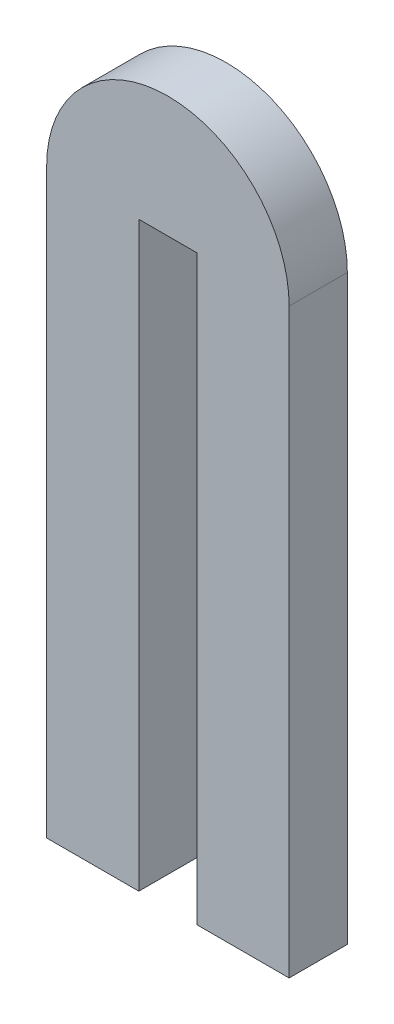
ISO-10303-21;
HEADER;
FILE_DESCRIPTION(('STEP AP214'),'2;1');
FILE_NAME('part.step','',(''),(''),'','','');
FILE_SCHEMA(('AUTOMOTIVE_DESIGN { 1 0 10303 214 1 1 1 1 }'));
ENDSEC;
DATA;
#1=APPLICATION_CONTEXT('core data for automotive mechanical design processes');
#2=APPLICATION_PROTOCOL_DEFINITION('international standard','automotive_design',2000,#1);
#3=PRODUCT_CONTEXT('',#1,'mechanical');
#4=PRODUCT('Part','Part','',(#3));
#5=PRODUCT_RELATED_PRODUCT_CATEGORY('part','',(#4));
#6=PRODUCT_DEFINITION_FORMATION('','',#4);
#7=PRODUCT_DEFINITION_CONTEXT('part definition',#1,'design');
#8=PRODUCT_DEFINITION('design','',#6,#7);
#9=PRODUCT_DEFINITION_SHAPE('','',#8);
#10=(LENGTH_UNIT() NAMED_UNIT(*) SI_UNIT(.MILLI.,.METRE.));
#11=(NAMED_UNIT(*) PLANE_ANGLE_UNIT() SI_UNIT($,.RADIAN.));
#12=(NAMED_UNIT(*) SI_UNIT($,.STERADIAN.) SOLID_ANGLE_UNIT());
#13=UNCERTAINTY_MEASURE_WITH_UNIT(LENGTH_MEASURE(1.E-05),#10,'distance_accuracy_value','');
#14=(GEOMETRIC_REPRESENTATION_CONTEXT(3) GLOBAL_UNCERTAINTY_ASSIGNED_CONTEXT((#13)) GLOBAL_UNIT_ASSIGNED_CONTEXT((#10,
#11,#12)) REPRESENTATION_CONTEXT('',''));
#15=CARTESIAN_POINT('',(0.,0.,0.));
#16=DIRECTION('',(0.,0.,1.));
#17=DIRECTION('',(1.,0.,0.));
#18=AXIS2_PLACEMENT_3D('',#15,#16,#17);
#19=CARTESIAN_POINT('',(6.25,15.,1.5));
#20=DIRECTION('',(-1.,0.,0.));
#21=DIRECTION('',(0.,-1.,0.));
#22=AXIS2_PLACEMENT_3D('',#19,#20,#21);
#23=PLANE('',#22);
#24=DIRECTION('',(0.,1.,0.));
#25=VECTOR('',#24,1.);
#26=CARTESIAN_POINT('',(6.25,15.,-1.5));
#27=LINE('',#26,#25);
#28=CARTESIAN_POINT('',(6.25,-15.,-1.5));
#29=VERTEX_POINT('',#28);
#30=CARTESIAN_POINT('',(6.25,15.,-1.5));
#31=VERTEX_POINT('',#30);
#32=EDGE_CURVE('E129',#29,#31,#27,.T.);
#33=ORIENTED_EDGE('',*,*,#32,.T.);
#34=DIRECTION('',(0.,0.,-1.));
#35=VECTOR('',#34,1.);
#36=CARTESIAN_POINT('',(6.25,15.,1.5));
#37=LINE('',#36,#35);
#38=CARTESIAN_POINT('',(6.25,15.,1.5));
#39=VERTEX_POINT('',#38);
#40=EDGE_CURVE('E11',#39,#31,#37,.T.);
#41=ORIENTED_EDGE('',*,*,#40,.F.);
#42=DIRECTION('',(0.,1.,0.));
#43=VECTOR('',#42,1.);
#44=CARTESIAN_POINT('',(6.25,15.,1.5));
#45=LINE('',#44,#43);
#46=CARTESIAN_POINT('',(6.25,-15.,1.5));
#47=VERTEX_POINT('',#46);
#48=EDGE_CURVE('E143',#47,#39,#45,.T.);
#49=ORIENTED_EDGE('',*,*,#48,.F.);
#50=DIRECTION('',(0.,0.,-1.));
#51=VECTOR('',#50,1.);
#52=CARTESIAN_POINT('',(6.25,-15.,1.5));
#53=LINE('',#52,#51);
#54=EDGE_CURVE('E125',#47,#29,#53,.T.);
#55=ORIENTED_EDGE('',*,*,#54,.T.);
#56=EDGE_LOOP('',(#33,#41,#49,#55));
#57=FACE_BOUND('',#56,.T.);
#58=ADVANCED_FACE('F33',(#57),#23,.F.);
#59=CARTESIAN_POINT('',(0.,15.,1.5));
#60=DIRECTION('',(0.,0.,-1.));
#61=DIRECTION('',(-1.,0.,0.));
#62=AXIS2_PLACEMENT_3D('',#59,#60,#61);
#63=CYLINDRICAL_SURFACE('',#62,6.25);
#64=CARTESIAN_POINT('',(0.,15.,-1.5));
#65=DIRECTION('',(0.,0.,1.));
#66=DIRECTION('',(1.,0.,0.));
#67=AXIS2_PLACEMENT_3D('',#64,#65,#66);
#68=CIRCLE('',#67,6.25);
#69=CARTESIAN_POINT('',(-6.25,15.,-1.5));
#70=VERTEX_POINT('',#69);
#71=EDGE_CURVE('E132',#31,#70,#68,.T.);
#72=ORIENTED_EDGE('',*,*,#71,.T.);
#73=DIRECTION('',(0.,0.,-1.));
#74=VECTOR('',#73,1.);
#75=CARTESIAN_POINT('',(-6.25,15.,1.5));
#76=LINE('',#75,#74);
#77=CARTESIAN_POINT('',(-6.25,15.,1.5));
#78=VERTEX_POINT('',#77);
#79=EDGE_CURVE('E41',#78,#70,#76,.T.);
#80=ORIENTED_EDGE('',*,*,#79,.F.);
#81=CARTESIAN_POINT('',(0.,15.,1.5));
#82=DIRECTION('',(0.,0.,1.));
#83=DIRECTION('',(1.,0.,0.));
#84=AXIS2_PLACEMENT_3D('',#81,#82,#83);
#85=CIRCLE('',#84,6.25);
#86=EDGE_CURVE('E92',#39,#78,#85,.T.);
#87=ORIENTED_EDGE('',*,*,#86,.F.);
#88=ORIENTED_EDGE('',*,*,#40,.T.);
#89=EDGE_LOOP('',(#72,#80,#87,#88));
#90=FACE_BOUND('',#89,.T.);
#91=ADVANCED_FACE('F178',(#90),#63,.T.);
#92=CARTESIAN_POINT('',(-6.25,15.,1.5));
#93=DIRECTION('',(1.,0.,0.));
#94=DIRECTION('',(0.,1.,0.));
#95=AXIS2_PLACEMENT_3D('',#92,#93,#94);
#96=PLANE('',#95);
#97=DIRECTION('',(0.,-1.,0.));
#98=VECTOR('',#97,1.);
#99=CARTESIAN_POINT('',(-6.25,15.,-1.5));
#100=LINE('',#99,#98);
#101=CARTESIAN_POINT('',(-6.25,-15.,-1.5));
#102=VERTEX_POINT('',#101);
#103=EDGE_CURVE('E134',#70,#102,#100,.T.);
#104=ORIENTED_EDGE('',*,*,#103,.T.);
#105=DIRECTION('',(0.,0.,-1.));
#106=VECTOR('',#105,1.);
#107=CARTESIAN_POINT('',(-6.25,-15.,1.5));
#108=LINE('',#107,#106);
#109=CARTESIAN_POINT('',(-6.25,-15.,1.5));
#110=VERTEX_POINT('',#109);
#111=EDGE_CURVE('E150',#110,#102,#108,.T.);
#112=ORIENTED_EDGE('',*,*,#111,.F.);
#113=DIRECTION('',(0.,-1.,0.));
#114=VECTOR('',#113,1.);
#115=CARTESIAN_POINT('',(-6.25,15.,1.5));
#116=LINE('',#115,#114);
#117=EDGE_CURVE('E158',#78,#110,#116,.T.);
#118=ORIENTED_EDGE('',*,*,#117,.F.);
#119=ORIENTED_EDGE('',*,*,#79,.T.);
#120=EDGE_LOOP('',(#104,#112,#118,#119));
#121=FACE_BOUND('',#120,.T.);
#122=ADVANCED_FACE('F156',(#121),#96,.F.);
#123=CARTESIAN_POINT('',(-6.25,-15.,1.5));
#124=DIRECTION('',(0.,1.,0.));
#125=DIRECTION('',(0.,0.,1.));
#126=AXIS2_PLACEMENT_3D('',#123,#124,#125);
#127=PLANE('',#126);
#128=DIRECTION('',(1.,0.,0.));
#129=VECTOR('',#128,1.);
#130=CARTESIAN_POINT('',(-6.25,-15.,-1.5));
#131=LINE('',#130,#129);
#132=CARTESIAN_POINT('',(-1.5,-15.,-1.5));
#133=VERTEX_POINT('',#132);
#134=EDGE_CURVE('E136',#102,#133,#131,.T.);
#135=ORIENTED_EDGE('',*,*,#134,.T.);
#136=DIRECTION('',(0.,0.,-1.));
#137=VECTOR('',#136,1.);
#138=CARTESIAN_POINT('',(-1.5,-15.,1.5));
#139=LINE('',#138,#137);
#140=CARTESIAN_POINT('',(-1.5,-15.,1.5));
#141=VERTEX_POINT('',#140);
#142=EDGE_CURVE('E147',#141,#133,#139,.T.);
#143=ORIENTED_EDGE('',*,*,#142,.F.);
#144=DIRECTION('',(1.,0.,0.));
#145=VECTOR('',#144,1.);
#146=CARTESIAN_POINT('',(-6.25,-15.,1.5));
#147=LINE('',#146,#145);
#148=EDGE_CURVE('E170',#110,#141,#147,.T.);
#149=ORIENTED_EDGE('',*,*,#148,.F.);
#150=ORIENTED_EDGE('',*,*,#111,.T.);
#151=EDGE_LOOP('',(#135,#143,#149,#150));
#152=FACE_BOUND('',#151,.T.);
#153=ADVANCED_FACE('F166',(#152),#127,.F.);
#154=CARTESIAN_POINT('',(-1.5,-15.,1.5));
#155=DIRECTION('',(-1.,0.,0.));
#156=DIRECTION('',(0.,0.,1.));
#157=AXIS2_PLACEMENT_3D('',#154,#155,#156);
#158=PLANE('',#157);
#159=DIRECTION('',(0.,1.,0.));
#160=VECTOR('',#159,1.);
#161=CARTESIAN_POINT('',(-1.5,-15.,-1.5));
#162=LINE('',#161,#160);
#163=CARTESIAN_POINT('',(-1.5,15.,-1.5));
#164=VERTEX_POINT('',#163);
#165=EDGE_CURVE('E138',#133,#164,#162,.T.);
#166=ORIENTED_EDGE('',*,*,#165,.T.);
#167=DIRECTION('',(0.,0.,-1.));
#168=VECTOR('',#167,1.);
#169=CARTESIAN_POINT('',(-1.5,15.,1.5));
#170=LINE('',#169,#168);
#171=CARTESIAN_POINT('',(-1.5,15.,1.5));
#172=VERTEX_POINT('',#171);
#173=EDGE_CURVE('E120',#172,#164,#170,.T.);
#174=ORIENTED_EDGE('',*,*,#173,.F.);
#175=DIRECTION('',(0.,1.,0.));
#176=VECTOR('',#175,1.);
#177=CARTESIAN_POINT('',(-1.5,-15.,1.5));
#178=LINE('',#177,#176);
#179=EDGE_CURVE('E111',#141,#172,#178,.T.);
#180=ORIENTED_EDGE('',*,*,#179,.F.);
#181=ORIENTED_EDGE('',*,*,#142,.T.);
#182=EDGE_LOOP('',(#166,#174,#180,#181));
#183=FACE_BOUND('',#182,.T.);
#184=ADVANCED_FACE('F169',(#183),#158,.F.);
#185=CARTESIAN_POINT('',(-1.5,15.,1.5));
#186=DIRECTION('',(0.,1.,0.));
#187=DIRECTION('',(0.,0.,1.));
#188=AXIS2_PLACEMENT_3D('',#185,#186,#187);
#189=PLANE('',#188);
#190=DIRECTION('',(1.,0.,0.));
#191=VECTOR('',#190,1.);
#192=CARTESIAN_POINT('',(-1.5,15.,-1.5));
#193=LINE('',#192,#191);
#194=CARTESIAN_POINT('',(1.5,15.,-1.5));
#195=VERTEX_POINT('',#194);
#196=EDGE_CURVE('E119',#164,#195,#193,.T.);
#197=ORIENTED_EDGE('',*,*,#196,.T.);
#198=DIRECTION('',(0.,0.,-1.));
#199=VECTOR('',#198,1.);
#200=CARTESIAN_POINT('',(1.5,15.,1.5));
#201=LINE('',#200,#199);
#202=CARTESIAN_POINT('',(1.5,15.,1.5));
#203=VERTEX_POINT('',#202);
#204=EDGE_CURVE('E116',#203,#195,#201,.T.);
#205=ORIENTED_EDGE('',*,*,#204,.F.);
#206=DIRECTION('',(1.,0.,0.));
#207=VECTOR('',#206,1.);
#208=CARTESIAN_POINT('',(-1.5,15.,1.5));
#209=LINE('',#208,#207);
#210=EDGE_CURVE('E105',#172,#203,#209,.T.);
#211=ORIENTED_EDGE('',*,*,#210,.F.);
#212=ORIENTED_EDGE('',*,*,#173,.T.);
#213=EDGE_LOOP('',(#197,#205,#211,#212));
#214=FACE_BOUND('',#213,.T.);
#215=ADVANCED_FACE('F117',(#214),#189,.F.);
#216=CARTESIAN_POINT('',(1.5,-15.,1.5));
#217=DIRECTION('',(1.,0.,0.));
#218=DIRECTION('',(0.,0.,-1.));
#219=AXIS2_PLACEMENT_3D('',#216,#217,#218);
#220=PLANE('',#219);
#221=DIRECTION('',(0.,-1.,0.));
#222=VECTOR('',#221,1.);
#223=CARTESIAN_POINT('',(1.5,-15.,-1.5));
#224=LINE('',#223,#222);
#225=CARTESIAN_POINT('',(1.5,-15.,-1.5));
#226=VERTEX_POINT('',#225);
#227=EDGE_CURVE('E78',#195,#226,#224,.T.);
#228=ORIENTED_EDGE('',*,*,#227,.T.);
#229=DIRECTION('',(0.,0.,-1.));
#230=VECTOR('',#229,1.);
#231=CARTESIAN_POINT('',(1.5,-15.,1.5));
#232=LINE('',#231,#230);
#233=CARTESIAN_POINT('',(1.5,-15.,1.5));
#234=VERTEX_POINT('',#233);
#235=EDGE_CURVE('E121',#234,#226,#232,.T.);
#236=ORIENTED_EDGE('',*,*,#235,.F.);
#237=DIRECTION('',(0.,-1.,0.));
#238=VECTOR('',#237,1.);
#239=CARTESIAN_POINT('',(1.5,-15.,1.5));
#240=LINE('',#239,#238);
#241=EDGE_CURVE('E109',#203,#234,#240,.T.);
#242=ORIENTED_EDGE('',*,*,#241,.F.);
#243=ORIENTED_EDGE('',*,*,#204,.T.);
#244=EDGE_LOOP('',(#228,#236,#242,#243));
#245=FACE_BOUND('',#244,.T.);
#246=ADVANCED_FACE('F123',(#245),#220,.F.);
#247=CARTESIAN_POINT('',(1.5,-15.,1.5));
#248=DIRECTION('',(0.,1.,0.));
#249=DIRECTION('',(0.,0.,1.));
#250=AXIS2_PLACEMENT_3D('',#247,#248,#249);
#251=PLANE('',#250);
#252=DIRECTION('',(1.,0.,0.));
#253=VECTOR('',#252,1.);
#254=CARTESIAN_POINT('',(1.5,-15.,-1.5));
#255=LINE('',#254,#253);
#256=EDGE_CURVE('E84',#226,#29,#255,.T.);
#257=ORIENTED_EDGE('',*,*,#256,.T.);
#258=ORIENTED_EDGE('',*,*,#54,.F.);
#259=DIRECTION('',(1.,0.,0.));
#260=VECTOR('',#259,1.);
#261=CARTESIAN_POINT('',(1.5,-15.,1.5));
#262=LINE('',#261,#260);
#263=EDGE_CURVE('E49',#234,#47,#262,.T.);
#264=ORIENTED_EDGE('',*,*,#263,.F.);
#265=ORIENTED_EDGE('',*,*,#235,.T.);
#266=EDGE_LOOP('',(#257,#258,#264,#265));
#267=FACE_BOUND('',#266,.T.);
#268=ADVANCED_FACE('F194',(#267),#251,.F.);
#269=CARTESIAN_POINT('',(0.,15.,1.5));
#270=DIRECTION('',(0.,0.,1.));
#271=DIRECTION('',(1.,0.,0.));
#272=AXIS2_PLACEMENT_3D('',#269,#270,#271);
#273=PLANE('',#272);
#274=ORIENTED_EDGE('',*,*,#48,.T.);
#275=ORIENTED_EDGE('',*,*,#86,.T.);
#276=ORIENTED_EDGE('',*,*,#117,.T.);
#277=ORIENTED_EDGE('',*,*,#148,.T.);
#278=ORIENTED_EDGE('',*,*,#179,.T.);
#279=ORIENTED_EDGE('',*,*,#210,.T.);
#280=ORIENTED_EDGE('',*,*,#241,.T.);
#281=ORIENTED_EDGE('',*,*,#263,.T.);
#282=EDGE_LOOP('',(#274,#275,#276,#277,#278,#279,#280,#281));
#283=FACE_BOUND('',#282,.T.);
#284=ADVANCED_FACE('F107',(#283),#273,.T.);
#285=CARTESIAN_POINT('',(0.,15.,-1.5));
#286=DIRECTION('',(0.,0.,1.));
#287=DIRECTION('',(1.,0.,0.));
#288=AXIS2_PLACEMENT_3D('',#285,#286,#287);
#289=PLANE('',#288);
#290=ORIENTED_EDGE('',*,*,#32,.F.);
#291=ORIENTED_EDGE('',*,*,#256,.F.);
#292=ORIENTED_EDGE('',*,*,#227,.F.);
#293=ORIENTED_EDGE('',*,*,#196,.F.);
#294=ORIENTED_EDGE('',*,*,#165,.F.);
#295=ORIENTED_EDGE('',*,*,#134,.F.);
#296=ORIENTED_EDGE('',*,*,#103,.F.);
#297=ORIENTED_EDGE('',*,*,#71,.F.);
#298=EDGE_LOOP('',(#290,#291,#292,#293,#294,#295,#296,#297));
#299=FACE_BOUND('',#298,.T.);
#300=ADVANCED_FACE('F162',(#299),#289,.F.);
#301=CLOSED_SHELL('',(#58,#91,#122,#153,#184,#215,#246,#268,#284,#300));
#302=MANIFOLD_SOLID_BREP('B2',#301);
#303=ADVANCED_BREP_SHAPE_REPRESENTATION('',(#18,#302),#14);
#304=SHAPE_DEFINITION_REPRESENTATION(#9,#303);
ENDSEC;
END-ISO-10303-21;
